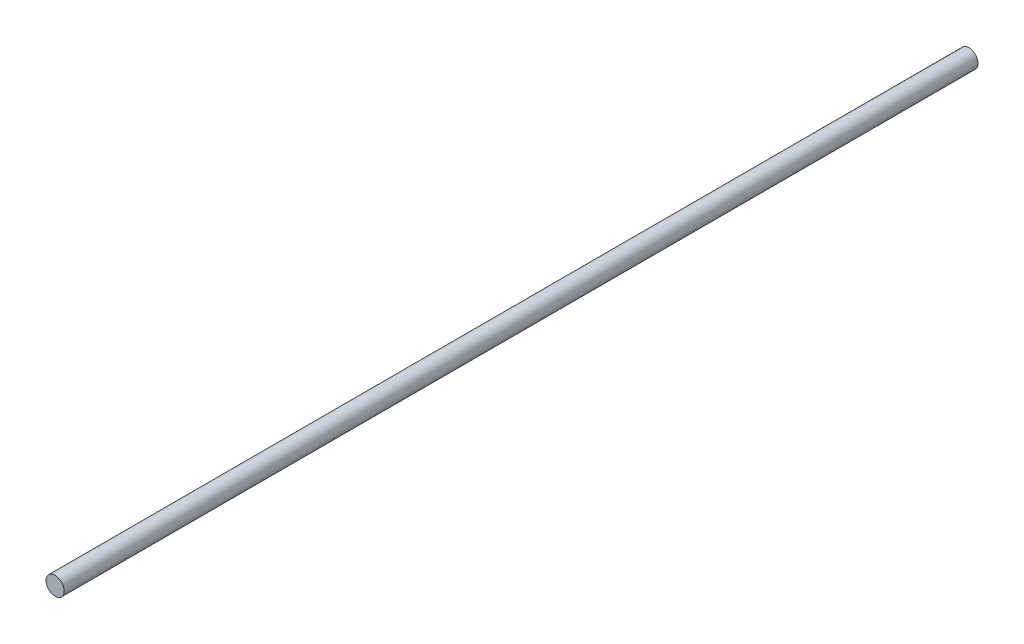
ISO-10303-21;
HEADER;
FILE_DESCRIPTION(('STEP AP214'),'2;1');
FILE_NAME('part.step','',(''),(''),'','','');
FILE_SCHEMA(('AUTOMOTIVE_DESIGN { 1 0 10303 214 1 1 1 1 }'));
ENDSEC;
DATA;
#1=APPLICATION_CONTEXT('core data for automotive mechanical design processes');
#2=APPLICATION_PROTOCOL_DEFINITION('international standard','automotive_design',2000,#1);
#3=PRODUCT_CONTEXT('',#1,'mechanical');
#4=PRODUCT('Part','Part','',(#3));
#5=PRODUCT_RELATED_PRODUCT_CATEGORY('part','',(#4));
#6=PRODUCT_DEFINITION_FORMATION('','',#4);
#7=PRODUCT_DEFINITION_CONTEXT('part definition',#1,'design');
#8=PRODUCT_DEFINITION('design','',#6,#7);
#9=PRODUCT_DEFINITION_SHAPE('','',#8);
#10=(LENGTH_UNIT() NAMED_UNIT(*) SI_UNIT(.MILLI.,.METRE.));
#11=(NAMED_UNIT(*) PLANE_ANGLE_UNIT() SI_UNIT($,.RADIAN.));
#12=(NAMED_UNIT(*) SI_UNIT($,.STERADIAN.) SOLID_ANGLE_UNIT());
#13=UNCERTAINTY_MEASURE_WITH_UNIT(LENGTH_MEASURE(1.E-05),#10,'distance_accuracy_value','');
#14=(GEOMETRIC_REPRESENTATION_CONTEXT(3) GLOBAL_UNCERTAINTY_ASSIGNED_CONTEXT((#13)) GLOBAL_UNIT_ASSIGNED_CONTEXT((#10,
#11,#12)) REPRESENTATION_CONTEXT('',''));
#15=CARTESIAN_POINT('',(0.,0.,0.));
#16=DIRECTION('',(0.,0.,1.));
#17=DIRECTION('',(1.,0.,0.));
#18=AXIS2_PLACEMENT_3D('',#15,#16,#17);
#19=CARTESIAN_POINT('',(0.,0.,201.));
#20=DIRECTION('',(0.,0.,-1.));
#21=DIRECTION('',(-1.,0.,0.));
#22=AXIS2_PLACEMENT_3D('',#19,#20,#21);
#23=CYLINDRICAL_SURFACE('',#22,4.);
#24=CARTESIAN_POINT('',(0.,0.,201.));
#25=DIRECTION('',(0.,0.,1.));
#26=DIRECTION('',(1.,0.,0.));
#27=AXIS2_PLACEMENT_3D('',#24,#25,#26);
#28=CIRCLE('',#27,4.);
#29=CARTESIAN_POINT('',(4.,0.,201.));
#30=VERTEX_POINT('',#29);
#31=EDGE_CURVE('E10',#30,#30,#28,.T.);
#32=ORIENTED_EDGE('',*,*,#31,.F.);
#33=EDGE_LOOP('',(#32));
#34=FACE_BOUND('',#33,.T.);
#35=CARTESIAN_POINT('',(0.,0.,-201.));
#36=DIRECTION('',(0.,0.,1.));
#37=DIRECTION('',(1.,0.,0.));
#38=AXIS2_PLACEMENT_3D('',#35,#36,#37);
#39=CIRCLE('',#38,4.);
#40=CARTESIAN_POINT('',(4.,0.,-201.));
#41=VERTEX_POINT('',#40);
#42=EDGE_CURVE('E33',#41,#41,#39,.T.);
#43=ORIENTED_EDGE('',*,*,#42,.T.);
#44=EDGE_LOOP('',(#43));
#45=FACE_BOUND('',#44,.T.);
#46=ADVANCED_FACE('F30',(#34,#45),#23,.T.);
#47=CARTESIAN_POINT('',(0.,0.,201.));
#48=DIRECTION('',(0.,0.,1.));
#49=DIRECTION('',(1.,0.,0.));
#50=AXIS2_PLACEMENT_3D('',#47,#48,#49);
#51=PLANE('',#50);
#52=ORIENTED_EDGE('',*,*,#31,.T.);
#53=EDGE_LOOP('',(#52));
#54=FACE_BOUND('',#53,.T.);
#55=ADVANCED_FACE('F45',(#54),#51,.T.);
#56=CARTESIAN_POINT('',(0.,0.,-201.));
#57=DIRECTION('',(0.,0.,1.));
#58=DIRECTION('',(1.,0.,0.));
#59=AXIS2_PLACEMENT_3D('',#56,#57,#58);
#60=PLANE('',#59);
#61=ORIENTED_EDGE('',*,*,#42,.F.);
#62=EDGE_LOOP('',(#61));
#63=FACE_BOUND('',#62,.T.);
#64=ADVANCED_FACE('F43',(#63),#60,.F.);
#65=CLOSED_SHELL('',(#46,#55,#64));
#66=MANIFOLD_SOLID_BREP('B2',#65);
#67=ADVANCED_BREP_SHAPE_REPRESENTATION('',(#18,#66),#14);
#68=SHAPE_DEFINITION_REPRESENTATION(#9,#67);
ENDSEC;
END-ISO-10303-21;
